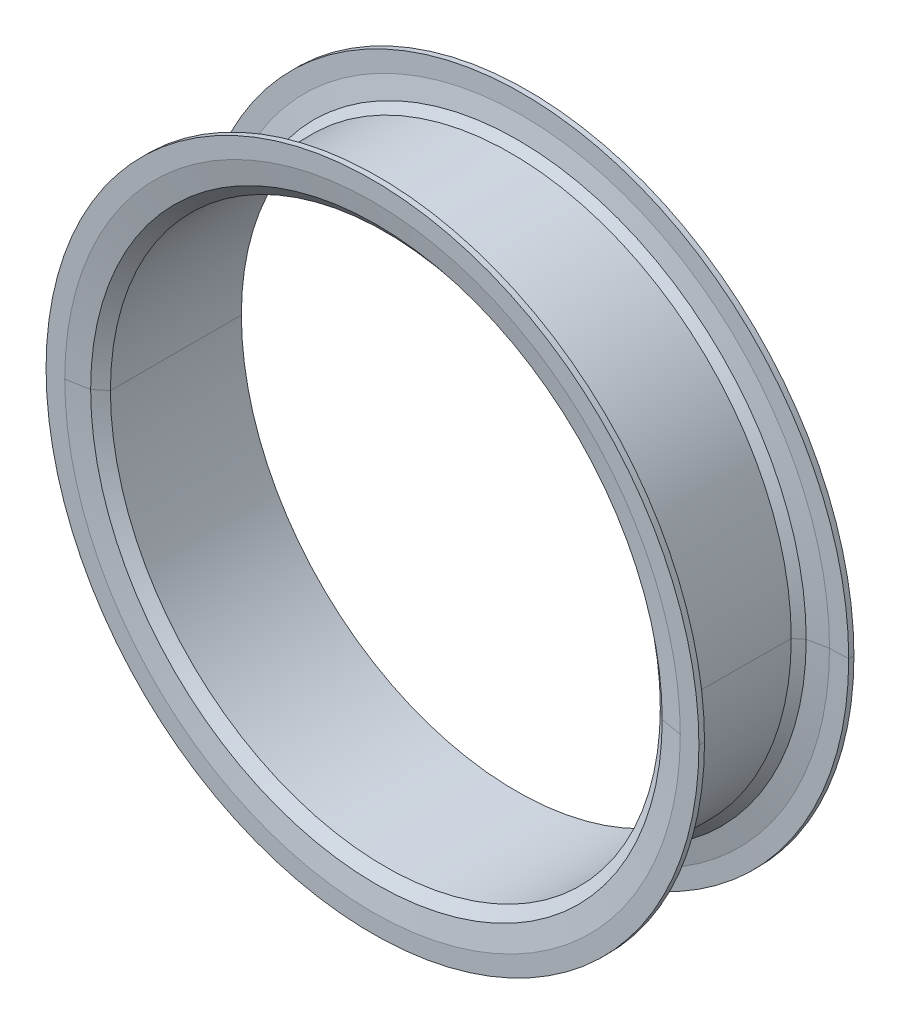
ISO-10303-21;
HEADER;
FILE_DESCRIPTION(('STEP AP214'),'2;1');
FILE_NAME('part.step','',(''),(''),'','','');
FILE_SCHEMA(('AUTOMOTIVE_DESIGN { 1 0 10303 214 1 1 1 1 }'));
ENDSEC;
DATA;
#1=APPLICATION_CONTEXT('core data for automotive mechanical design processes');
#2=APPLICATION_PROTOCOL_DEFINITION('international standard','automotive_design',2000,#1);
#3=PRODUCT_CONTEXT('',#1,'mechanical');
#4=PRODUCT('Part','Part','',(#3));
#5=PRODUCT_RELATED_PRODUCT_CATEGORY('part','',(#4));
#6=PRODUCT_DEFINITION_FORMATION('','',#4);
#7=PRODUCT_DEFINITION_CONTEXT('part definition',#1,'design');
#8=PRODUCT_DEFINITION('design','',#6,#7);
#9=PRODUCT_DEFINITION_SHAPE('','',#8);
#10=(LENGTH_UNIT() NAMED_UNIT(*) SI_UNIT(.MILLI.,.METRE.));
#11=(NAMED_UNIT(*) PLANE_ANGLE_UNIT() SI_UNIT($,.RADIAN.));
#12=(NAMED_UNIT(*) SI_UNIT($,.STERADIAN.) SOLID_ANGLE_UNIT());
#13=UNCERTAINTY_MEASURE_WITH_UNIT(LENGTH_MEASURE(1.E-05),#10,'distance_accuracy_value','');
#14=(GEOMETRIC_REPRESENTATION_CONTEXT(3) GLOBAL_UNCERTAINTY_ASSIGNED_CONTEXT((#13)) GLOBAL_UNIT_ASSIGNED_CONTEXT((#10,
#11,#12)) REPRESENTATION_CONTEXT('',''));
#15=CARTESIAN_POINT('',(0.,0.,0.));
#16=DIRECTION('',(0.,0.,1.));
#17=DIRECTION('',(1.,0.,0.));
#18=AXIS2_PLACEMENT_3D('',#15,#16,#17);
#19=CARTESIAN_POINT('',(0.,0.,31.5));
#20=DIRECTION('',(0.,0.,1.));
#21=DIRECTION('',(1.,0.,0.));
#22=AXIS2_PLACEMENT_3D('',#19,#20,#21);
#23=CONICAL_SURFACE('',#22,150.3,0.879459398025432);
#24=DIRECTION('',(0.770394321124688,0.,0.637567714034228));
#25=VECTOR('',#24,1.);
#26=CARTESIAN_POINT('',(150.3,0.,31.5));
#27=LINE('',#26,#25);
#28=CARTESIAN_POINT('',(147.4,0.,29.1));
#29=VERTEX_POINT('',#28);
#30=CARTESIAN_POINT('',(153.2,0.,33.9));
#31=VERTEX_POINT('',#30);
#32=EDGE_CURVE('E62',#29,#31,#27,.T.);
#33=ORIENTED_EDGE('',*,*,#32,.F.);
#34=CARTESIAN_POINT('',(0.,0.,29.1));
#35=DIRECTION('',(0.,0.,1.));
#36=DIRECTION('',(1.,0.,0.));
#37=AXIS2_PLACEMENT_3D('',#34,#35,#36);
#38=CIRCLE('',#37,147.4);
#39=CARTESIAN_POINT('',(-147.4,0.,29.1));
#40=VERTEX_POINT('',#39);
#41=EDGE_CURVE('E191',#40,#29,#38,.T.);
#42=ORIENTED_EDGE('',*,*,#41,.F.);
#43=DIRECTION('',(0.770394321124688,0.,-0.637567714034228));
#44=VECTOR('',#43,1.);
#45=CARTESIAN_POINT('',(-150.3,0.,31.5));
#46=LINE('',#45,#44);
#47=CARTESIAN_POINT('',(-153.2,0.,33.9));
#48=VERTEX_POINT('',#47);
#49=EDGE_CURVE('E202',#48,#40,#46,.T.);
#50=ORIENTED_EDGE('',*,*,#49,.F.);
#51=CARTESIAN_POINT('',(0.,0.,33.9));
#52=DIRECTION('',(0.,0.,1.));
#53=DIRECTION('',(1.,0.,0.));
#54=AXIS2_PLACEMENT_3D('',#51,#52,#53);
#55=CIRCLE('',#54,153.2);
#56=EDGE_CURVE('E11',#48,#31,#55,.T.);
#57=ORIENTED_EDGE('',*,*,#56,.T.);
#58=EDGE_LOOP('',(#33,#42,#50,#57));
#59=FACE_BOUND('',#58,.T.);
#60=ADVANCED_FACE('F44',(#59),#23,.F.);
#61=CARTESIAN_POINT('',(0.,0.,34.95));
#62=DIRECTION('',(0.,0.,1.));
#63=DIRECTION('',(1.,0.,0.));
#64=AXIS2_PLACEMENT_3D('',#61,#62,#63);
#65=CONICAL_SURFACE('',#64,159.1,1.39467415296908);
#66=DIRECTION('',(0.984530539330824,0.,0.175213062084299));
#67=VECTOR('',#66,1.);
#68=CARTESIAN_POINT('',(159.1,0.,34.95));
#69=LINE('',#68,#67);
#70=CARTESIAN_POINT('',(165.,0.,36.));
#71=VERTEX_POINT('',#70);
#72=EDGE_CURVE('E231',#31,#71,#69,.T.);
#73=ORIENTED_EDGE('',*,*,#72,.F.);
#74=ORIENTED_EDGE('',*,*,#56,.F.);
#75=DIRECTION('',(0.984530539330824,0.,-0.175213062084299));
#76=VECTOR('',#75,1.);
#77=CARTESIAN_POINT('',(-159.1,0.,34.95));
#78=LINE('',#77,#76);
#79=CARTESIAN_POINT('',(-165.,0.,36.));
#80=VERTEX_POINT('',#79);
#81=EDGE_CURVE('E280',#80,#48,#78,.T.);
#82=ORIENTED_EDGE('',*,*,#81,.F.);
#83=CARTESIAN_POINT('',(0.,0.,36.));
#84=DIRECTION('',(0.,0.,1.));
#85=DIRECTION('',(1.,0.,0.));
#86=AXIS2_PLACEMENT_3D('',#83,#84,#85);
#87=CIRCLE('',#86,165.);
#88=EDGE_CURVE('E54',#80,#71,#87,.T.);
#89=ORIENTED_EDGE('',*,*,#88,.T.);
#90=EDGE_LOOP('',(#73,#74,#82,#89));
#91=FACE_BOUND('',#90,.T.);
#92=ADVANCED_FACE('F395',(#91),#65,.F.);
#93=CARTESIAN_POINT('',(0.,0.,34.5));
#94=DIRECTION('',(0.,0.,1.));
#95=DIRECTION('',(1.,0.,0.));
#96=AXIS2_PLACEMENT_3D('',#93,#94,#95);
#97=CYLINDRICAL_SURFACE('',#96,175.);
#98=DIRECTION('',(0.,0.,1.));
#99=VECTOR('',#98,1.);
#100=CARTESIAN_POINT('',(175.,0.,34.5));
#101=LINE('',#100,#99);
#102=CARTESIAN_POINT('',(175.,0.,33.));
#103=VERTEX_POINT('',#102);
#104=CARTESIAN_POINT('',(175.,0.,36.));
#105=VERTEX_POINT('',#104);
#106=EDGE_CURVE('E224',#103,#105,#101,.T.);
#107=ORIENTED_EDGE('',*,*,#106,.F.);
#108=CARTESIAN_POINT('',(0.,0.,33.));
#109=DIRECTION('',(0.,0.,1.));
#110=DIRECTION('',(1.,0.,0.));
#111=AXIS2_PLACEMENT_3D('',#108,#109,#110);
#112=CIRCLE('',#111,175.);
#113=CARTESIAN_POINT('',(-175.,0.,33.));
#114=VERTEX_POINT('',#113);
#115=EDGE_CURVE('E198',#103,#114,#112,.T.);
#116=ORIENTED_EDGE('',*,*,#115,.T.);
#117=DIRECTION('',(0.,0.,-1.));
#118=VECTOR('',#117,1.);
#119=CARTESIAN_POINT('',(-175.,0.,34.5));
#120=LINE('',#119,#118);
#121=CARTESIAN_POINT('',(-175.,0.,36.));
#122=VERTEX_POINT('',#121);
#123=EDGE_CURVE('E217',#122,#114,#120,.T.);
#124=ORIENTED_EDGE('',*,*,#123,.F.);
#125=CARTESIAN_POINT('',(0.,0.,36.));
#126=DIRECTION('',(0.,0.,1.));
#127=DIRECTION('',(1.,0.,0.));
#128=AXIS2_PLACEMENT_3D('',#125,#126,#127);
#129=CIRCLE('',#128,175.);
#130=EDGE_CURVE('E218',#105,#122,#129,.T.);
#131=ORIENTED_EDGE('',*,*,#130,.F.);
#132=EDGE_LOOP('',(#107,#116,#124,#131));
#133=FACE_BOUND('',#132,.T.);
#134=ADVANCED_FACE('F380',(#133),#97,.T.);
#135=CARTESIAN_POINT('',(0.,0.,32.9));
#136=DIRECTION('',(0.,0.,1.));
#137=DIRECTION('',(1.,0.,0.));
#138=AXIS2_PLACEMENT_3D('',#135,#136,#137);
#139=CONICAL_SURFACE('',#138,170.,1.55079899282175);
#140=DIRECTION('',(0.999800059980007,0.,0.0199960011996004));
#141=VECTOR('',#140,1.);
#142=CARTESIAN_POINT('',(170.,0.,32.9));
#143=LINE('',#142,#141);
#144=CARTESIAN_POINT('',(165.,0.,32.8));
#145=VERTEX_POINT('',#144);
#146=EDGE_CURVE('E182',#145,#103,#143,.T.);
#147=ORIENTED_EDGE('',*,*,#146,.F.);
#148=CARTESIAN_POINT('',(0.,0.,32.8));
#149=DIRECTION('',(0.,0.,1.));
#150=DIRECTION('',(1.,0.,0.));
#151=AXIS2_PLACEMENT_3D('',#148,#149,#150);
#152=CIRCLE('',#151,165.);
#153=CARTESIAN_POINT('',(-165.,0.,32.8));
#154=VERTEX_POINT('',#153);
#155=EDGE_CURVE('E179',#145,#154,#152,.T.);
#156=ORIENTED_EDGE('',*,*,#155,.T.);
#157=DIRECTION('',(0.999800059980007,0.,-0.0199960011996004));
#158=VECTOR('',#157,1.);
#159=CARTESIAN_POINT('',(-170.,0.,32.9));
#160=LINE('',#159,#158);
#161=EDGE_CURVE('E185',#114,#154,#160,.T.);
#162=ORIENTED_EDGE('',*,*,#161,.F.);
#163=ORIENTED_EDGE('',*,*,#115,.F.);
#164=EDGE_LOOP('',(#147,#156,#162,#163));
#165=FACE_BOUND('',#164,.T.);
#166=ADVANCED_FACE('F371',(#165),#139,.T.);
#167=CARTESIAN_POINT('',(0.,0.,31.75));
#168=DIRECTION('',(0.,0.,1.));
#169=DIRECTION('',(1.,0.,0.));
#170=AXIS2_PLACEMENT_3D('',#167,#168,#169);
#171=CONICAL_SURFACE('',#170,159.5,1.38215711057039);
#172=DIRECTION('',(0.982260321953668,0.,0.187522425100245));
#173=VECTOR('',#172,1.);
#174=CARTESIAN_POINT('',(159.5,0.,31.75));
#175=LINE('',#174,#173);
#176=CARTESIAN_POINT('',(154.,0.,30.7));
#177=VERTEX_POINT('',#176);
#178=EDGE_CURVE('E160',#177,#145,#175,.T.);
#179=ORIENTED_EDGE('',*,*,#178,.F.);
#180=CARTESIAN_POINT('',(0.,0.,30.7));
#181=DIRECTION('',(0.,0.,1.));
#182=DIRECTION('',(1.,0.,0.));
#183=AXIS2_PLACEMENT_3D('',#180,#181,#182);
#184=CIRCLE('',#183,154.);
#185=CARTESIAN_POINT('',(-154.,0.,30.7));
#186=VERTEX_POINT('',#185);
#187=EDGE_CURVE('E167',#177,#186,#184,.T.);
#188=ORIENTED_EDGE('',*,*,#187,.T.);
#189=DIRECTION('',(0.982260321953668,0.,-0.187522425100245));
#190=VECTOR('',#189,1.);
#191=CARTESIAN_POINT('',(-159.5,0.,31.75));
#192=LINE('',#191,#190);
#193=EDGE_CURVE('E148',#154,#186,#192,.T.);
#194=ORIENTED_EDGE('',*,*,#193,.F.);
#195=ORIENTED_EDGE('',*,*,#155,.F.);
#196=EDGE_LOOP('',(#179,#188,#194,#195));
#197=FACE_BOUND('',#196,.T.);
#198=ADVANCED_FACE('F177',(#197),#171,.T.);
#199=CARTESIAN_POINT('',(0.,0.,28.5));
#200=DIRECTION('',(0.,0.,1.));
#201=DIRECTION('',(1.,0.,0.));
#202=AXIS2_PLACEMENT_3D('',#199,#200,#201);
#203=CONICAL_SURFACE('',#202,151.9,0.762146540586983);
#204=DIRECTION('',(0.690475746682499,0.,0.723355544143574));
#205=VECTOR('',#204,1.);
#206=CARTESIAN_POINT('',(151.9,0.,28.5));
#207=LINE('',#206,#205);
#208=CARTESIAN_POINT('',(149.8,0.,26.3));
#209=VERTEX_POINT('',#208);
#210=EDGE_CURVE('E174',#209,#177,#207,.T.);
#211=ORIENTED_EDGE('',*,*,#210,.F.);
#212=CARTESIAN_POINT('',(0.,0.,26.3));
#213=DIRECTION('',(0.,0.,1.));
#214=DIRECTION('',(1.,0.,0.));
#215=AXIS2_PLACEMENT_3D('',#212,#213,#214);
#216=CIRCLE('',#215,149.8);
#217=CARTESIAN_POINT('',(-149.8,0.,26.3));
#218=VERTEX_POINT('',#217);
#219=EDGE_CURVE('E169',#209,#218,#216,.T.);
#220=ORIENTED_EDGE('',*,*,#219,.T.);
#221=DIRECTION('',(0.690475746682499,0.,-0.723355544143574));
#222=VECTOR('',#221,1.);
#223=CARTESIAN_POINT('',(-151.9,0.,28.5));
#224=LINE('',#223,#222);
#225=EDGE_CURVE('E165',#186,#218,#224,.T.);
#226=ORIENTED_EDGE('',*,*,#225,.F.);
#227=ORIENTED_EDGE('',*,*,#187,.F.);
#228=EDGE_LOOP('',(#211,#220,#226,#227));
#229=FACE_BOUND('',#228,.T.);
#230=ADVANCED_FACE('F166',(#229),#203,.T.);
#231=CARTESIAN_POINT('',(0.,0.,-6.));
#232=DIRECTION('',(0.,0.,-1.));
#233=DIRECTION('',(1.,0.,0.));
#234=AXIS2_PLACEMENT_3D('',#231,#232,#233);
#235=CONICAL_SURFACE('',#234,150.,0.00619187133254888);
#236=DIRECTION('',(-0.00619183176734297,0.,0.999980830425946));
#237=VECTOR('',#236,1.);
#238=CARTESIAN_POINT('',(150.,0.,-6.));
#239=LINE('',#238,#237);
#240=CARTESIAN_POINT('',(150.2,0.,-38.3));
#241=VERTEX_POINT('',#240);
#242=EDGE_CURVE('E48',#241,#209,#239,.T.);
#243=ORIENTED_EDGE('',*,*,#242,.F.);
#244=CARTESIAN_POINT('',(0.,0.,-38.3));
#245=DIRECTION('',(0.,0.,1.));
#246=DIRECTION('',(1.,0.,0.));
#247=AXIS2_PLACEMENT_3D('',#244,#245,#246);
#248=CIRCLE('',#247,150.2);
#249=CARTESIAN_POINT('',(-150.2,0.,-38.3));
#250=VERTEX_POINT('',#249);
#251=EDGE_CURVE('E213',#241,#250,#248,.T.);
#252=ORIENTED_EDGE('',*,*,#251,.T.);
#253=DIRECTION('',(-0.00619183176734297,0.,-0.999980830425946));
#254=VECTOR('',#253,1.);
#255=CARTESIAN_POINT('',(-150.,0.,-6.));
#256=LINE('',#255,#254);
#257=EDGE_CURVE('E261',#218,#250,#256,.T.);
#258=ORIENTED_EDGE('',*,*,#257,.F.);
#259=ORIENTED_EDGE('',*,*,#219,.F.);
#260=EDGE_LOOP('',(#243,#252,#258,#259));
#261=FACE_BOUND('',#260,.T.);
#262=ADVANCED_FACE('F420',(#261),#235,.T.);
#263=CARTESIAN_POINT('',(0.,0.,-40.1));
#264=DIRECTION('',(0.,0.,-1.));
#265=DIRECTION('',(1.,0.,0.));
#266=AXIS2_PLACEMENT_3D('',#263,#264,#265);
#267=CONICAL_SURFACE('',#266,152.4,0.885066815888611);
#268=DIRECTION('',(-0.773957299203321,0.,0.633237790257262));
#269=VECTOR('',#268,1.);
#270=CARTESIAN_POINT('',(152.4,0.,-40.1));
#271=LINE('',#270,#269);
#272=CARTESIAN_POINT('',(154.6,0.,-41.9));
#273=VERTEX_POINT('',#272);
#274=EDGE_CURVE('E238',#273,#241,#271,.T.);
#275=ORIENTED_EDGE('',*,*,#274,.F.);
#276=CARTESIAN_POINT('',(0.,0.,-41.9));
#277=DIRECTION('',(0.,0.,1.));
#278=DIRECTION('',(1.,0.,0.));
#279=AXIS2_PLACEMENT_3D('',#276,#277,#278);
#280=CIRCLE('',#279,154.6);
#281=CARTESIAN_POINT('',(-154.6,0.,-41.9));
#282=VERTEX_POINT('',#281);
#283=EDGE_CURVE('E258',#273,#282,#280,.T.);
#284=ORIENTED_EDGE('',*,*,#283,.T.);
#285=DIRECTION('',(-0.773957299203321,0.,-0.633237790257262));
#286=VECTOR('',#285,1.);
#287=CARTESIAN_POINT('',(-152.4,0.,-40.1));
#288=LINE('',#287,#286);
#289=EDGE_CURVE('E235',#250,#282,#288,.T.);
#290=ORIENTED_EDGE('',*,*,#289,.F.);
#291=ORIENTED_EDGE('',*,*,#251,.F.);
#292=EDGE_LOOP('',(#275,#284,#290,#291));
#293=FACE_BOUND('',#292,.T.);
#294=ADVANCED_FACE('F303',(#293),#267,.T.);
#295=CARTESIAN_POINT('',(0.,0.,-42.95));
#296=DIRECTION('',(0.,0.,-1.));
#297=DIRECTION('',(1.,0.,0.));
#298=AXIS2_PLACEMENT_3D('',#295,#296,#297);
#299=CONICAL_SURFACE('',#298,159.8,1.37155234021469);
#300=DIRECTION('',(-0.980216494425521,0.,0.197928330605153));
#301=VECTOR('',#300,1.);
#302=CARTESIAN_POINT('',(159.8,0.,-42.95));
#303=LINE('',#302,#301);
#304=CARTESIAN_POINT('',(165.,0.,-44.));
#305=VERTEX_POINT('',#304);
#306=EDGE_CURVE('E314',#305,#273,#303,.T.);
#307=ORIENTED_EDGE('',*,*,#306,.F.);
#308=CARTESIAN_POINT('',(0.,0.,-44.));
#309=DIRECTION('',(0.,0.,1.));
#310=DIRECTION('',(1.,0.,0.));
#311=AXIS2_PLACEMENT_3D('',#308,#309,#310);
#312=CIRCLE('',#311,165.);
#313=CARTESIAN_POINT('',(-165.,0.,-44.));
#314=VERTEX_POINT('',#313);
#315=EDGE_CURVE('E274',#305,#314,#312,.T.);
#316=ORIENTED_EDGE('',*,*,#315,.T.);
#317=DIRECTION('',(-0.980216494425521,0.,-0.197928330605153));
#318=VECTOR('',#317,1.);
#319=CARTESIAN_POINT('',(-159.8,0.,-42.95));
#320=LINE('',#319,#318);
#321=EDGE_CURVE('E289',#282,#314,#320,.T.);
#322=ORIENTED_EDGE('',*,*,#321,.F.);
#323=ORIENTED_EDGE('',*,*,#283,.F.);
#324=EDGE_LOOP('',(#307,#316,#322,#323));
#325=FACE_BOUND('',#324,.T.);
#326=ADVANCED_FACE('F342',(#325),#299,.T.);
#327=CARTESIAN_POINT('',(0.,0.,-44.15));
#328=DIRECTION('',(0.,0.,-1.));
#329=DIRECTION('',(1.,0.,0.));
#330=AXIS2_PLACEMENT_3D('',#327,#328,#329);
#331=CONICAL_SURFACE('',#330,170.,1.54080532193802);
#332=DIRECTION('',(-0.999550303522367,0.,0.0299865091056707));
#333=VECTOR('',#332,1.);
#334=CARTESIAN_POINT('',(170.,0.,-44.15));
#335=LINE('',#334,#333);
#336=CARTESIAN_POINT('',(175.,0.,-44.3));
#337=VERTEX_POINT('',#336);
#338=EDGE_CURVE('E219',#337,#305,#335,.T.);
#339=ORIENTED_EDGE('',*,*,#338,.F.);
#340=CARTESIAN_POINT('',(0.,0.,-44.3));
#341=DIRECTION('',(0.,0.,1.));
#342=DIRECTION('',(1.,0.,0.));
#343=AXIS2_PLACEMENT_3D('',#340,#341,#342);
#344=CIRCLE('',#343,175.);
#345=CARTESIAN_POINT('',(-175.,0.,-44.3));
#346=VERTEX_POINT('',#345);
#347=EDGE_CURVE('E271',#337,#346,#344,.T.);
#348=ORIENTED_EDGE('',*,*,#347,.T.);
#349=DIRECTION('',(-0.999550303522367,0.,-0.0299865091056707));
#350=VECTOR('',#349,1.);
#351=CARTESIAN_POINT('',(-170.,0.,-44.15));
#352=LINE('',#351,#350);
#353=EDGE_CURVE('E223',#314,#346,#352,.T.);
#354=ORIENTED_EDGE('',*,*,#353,.F.);
#355=ORIENTED_EDGE('',*,*,#315,.F.);
#356=EDGE_LOOP('',(#339,#348,#354,#355));
#357=FACE_BOUND('',#356,.T.);
#358=ADVANCED_FACE('F348',(#357),#331,.T.);
#359=CARTESIAN_POINT('',(0.,0.,-45.7));
#360=DIRECTION('',(0.,0.,1.));
#361=DIRECTION('',(1.,0.,0.));
#362=AXIS2_PLACEMENT_3D('',#359,#360,#361);
#363=CYLINDRICAL_SURFACE('',#362,175.);
#364=DIRECTION('',(0.,0.,1.));
#365=VECTOR('',#364,1.);
#366=CARTESIAN_POINT('',(175.,0.,-45.7));
#367=LINE('',#366,#365);
#368=CARTESIAN_POINT('',(175.,0.,-47.1));
#369=VERTEX_POINT('',#368);
#370=EDGE_CURVE('E203',#369,#337,#367,.T.);
#371=ORIENTED_EDGE('',*,*,#370,.F.);
#372=CARTESIAN_POINT('',(0.,0.,-47.1));
#373=DIRECTION('',(0.,0.,1.));
#374=DIRECTION('',(1.,0.,0.));
#375=AXIS2_PLACEMENT_3D('',#372,#373,#374);
#376=CIRCLE('',#375,175.);
#377=CARTESIAN_POINT('',(-175.,0.,-47.1));
#378=VERTEX_POINT('',#377);
#379=EDGE_CURVE('E275',#369,#378,#376,.T.);
#380=ORIENTED_EDGE('',*,*,#379,.T.);
#381=DIRECTION('',(0.,0.,-1.));
#382=VECTOR('',#381,1.);
#383=CARTESIAN_POINT('',(-175.,0.,-45.7));
#384=LINE('',#383,#382);
#385=EDGE_CURVE('E207',#346,#378,#384,.T.);
#386=ORIENTED_EDGE('',*,*,#385,.F.);
#387=ORIENTED_EDGE('',*,*,#347,.F.);
#388=EDGE_LOOP('',(#371,#380,#386,#387));
#389=FACE_BOUND('',#388,.T.);
#390=ADVANCED_FACE('F354',(#389),#363,.T.);
#391=CARTESIAN_POINT('',(0.,0.,-47.05));
#392=DIRECTION('',(0.,0.,-1.));
#393=DIRECTION('',(1.,0.,0.));
#394=AXIS2_PLACEMENT_3D('',#391,#392,#393);
#395=CONICAL_SURFACE('',#394,170.,1.56079666010823);
#396=DIRECTION('',(-0.999950003749687,0.,0.00999950003749702));
#397=VECTOR('',#396,1.);
#398=CARTESIAN_POINT('',(170.,0.,-47.05));
#399=LINE('',#398,#397);
#400=CARTESIAN_POINT('',(165.,0.,-47.));
#401=VERTEX_POINT('',#400);
#402=EDGE_CURVE('E230',#369,#401,#399,.T.);
#403=ORIENTED_EDGE('',*,*,#402,.F.);
#404=CARTESIAN_POINT('',(0.,0.,-47.1));
#405=DIRECTION('',(0.,0.,1.));
#406=DIRECTION('',(1.,0.,0.));
#407=AXIS2_PLACEMENT_3D('',#404,#405,#406);
#408=CIRCLE('',#407,175.);
#409=EDGE_CURVE('E222',#378,#369,#408,.T.);
#410=ORIENTED_EDGE('',*,*,#409,.F.);
#411=DIRECTION('',(-0.999950003749687,0.,-0.00999950003749702));
#412=VECTOR('',#411,1.);
#413=CARTESIAN_POINT('',(-170.,0.,-47.05));
#414=LINE('',#413,#412);
#415=CARTESIAN_POINT('',(-165.,0.,-47.));
#416=VERTEX_POINT('',#415);
#417=EDGE_CURVE('E206',#416,#378,#414,.T.);
#418=ORIENTED_EDGE('',*,*,#417,.F.);
#419=CARTESIAN_POINT('',(0.,0.,-47.));
#420=DIRECTION('',(0.,0.,1.));
#421=DIRECTION('',(1.,0.,0.));
#422=AXIS2_PLACEMENT_3D('',#419,#420,#421);
#423=CIRCLE('',#422,165.);
#424=EDGE_CURVE('E249',#416,#401,#423,.T.);
#425=ORIENTED_EDGE('',*,*,#424,.T.);
#426=EDGE_LOOP('',(#403,#410,#418,#425));
#427=FACE_BOUND('',#426,.T.);
#428=ADVANCED_FACE('F361',(#427),#395,.F.);
#429=CARTESIAN_POINT('',(0.,0.,-45.95));
#430=DIRECTION('',(0.,0.,-1.));
#431=DIRECTION('',(1.,0.,0.));
#432=AXIS2_PLACEMENT_3D('',#429,#430,#431);
#433=CONICAL_SURFACE('',#432,159.5,1.38215711057039);
#434=DIRECTION('',(-0.982260321953668,0.,0.187522425100246));
#435=VECTOR('',#434,1.);
#436=CARTESIAN_POINT('',(159.5,0.,-45.95));
#437=LINE('',#436,#435);
#438=CARTESIAN_POINT('',(154.,0.,-44.9));
#439=VERTEX_POINT('',#438);
#440=EDGE_CURVE('E244',#401,#439,#437,.T.);
#441=ORIENTED_EDGE('',*,*,#440,.F.);
#442=ORIENTED_EDGE('',*,*,#424,.F.);
#443=DIRECTION('',(-0.982260321953668,0.,-0.187522425100246));
#444=VECTOR('',#443,1.);
#445=CARTESIAN_POINT('',(-159.5,0.,-45.95));
#446=LINE('',#445,#444);
#447=CARTESIAN_POINT('',(-154.,0.,-44.9));
#448=VERTEX_POINT('',#447);
#449=EDGE_CURVE('E267',#448,#416,#446,.T.);
#450=ORIENTED_EDGE('',*,*,#449,.F.);
#451=CARTESIAN_POINT('',(0.,0.,-44.9));
#452=DIRECTION('',(0.,0.,1.));
#453=DIRECTION('',(1.,0.,0.));
#454=AXIS2_PLACEMENT_3D('',#451,#452,#453);
#455=CIRCLE('',#454,154.);
#456=EDGE_CURVE('E247',#448,#439,#455,.T.);
#457=ORIENTED_EDGE('',*,*,#456,.T.);
#458=EDGE_LOOP('',(#441,#442,#450,#457));
#459=FACE_BOUND('',#458,.T.);
#460=ADVANCED_FACE('F441',(#459),#433,.F.);
#461=CARTESIAN_POINT('',(0.,0.,-43.));
#462=DIRECTION('',(0.,0.,-1.));
#463=DIRECTION('',(1.,0.,0.));
#464=AXIS2_PLACEMENT_3D('',#461,#462,#463);
#465=CONICAL_SURFACE('',#464,150.7,1.04839289507837);
#466=DIRECTION('',(-0.866622456874169,0.,0.498964444866946));
#467=VECTOR('',#466,1.);
#468=CARTESIAN_POINT('',(150.7,0.,-43.));
#469=LINE('',#468,#467);
#470=CARTESIAN_POINT('',(147.4,0.,-41.1));
#471=VERTEX_POINT('',#470);
#472=EDGE_CURVE('E255',#439,#471,#469,.T.);
#473=ORIENTED_EDGE('',*,*,#472,.F.);
#474=ORIENTED_EDGE('',*,*,#456,.F.);
#475=DIRECTION('',(-0.866622456874169,0.,-0.498964444866946));
#476=VECTOR('',#475,1.);
#477=CARTESIAN_POINT('',(-150.7,0.,-43.));
#478=LINE('',#477,#476);
#479=CARTESIAN_POINT('',(-147.4,0.,-41.1));
#480=VERTEX_POINT('',#479);
#481=EDGE_CURVE('E240',#480,#448,#478,.T.);
#482=ORIENTED_EDGE('',*,*,#481,.F.);
#483=CARTESIAN_POINT('',(0.,0.,-41.1));
#484=DIRECTION('',(0.,0.,1.));
#485=DIRECTION('',(1.,0.,0.));
#486=AXIS2_PLACEMENT_3D('',#483,#484,#485);
#487=CIRCLE('',#486,147.4);
#488=EDGE_CURVE('E194',#480,#471,#487,.T.);
#489=ORIENTED_EDGE('',*,*,#488,.T.);
#490=EDGE_LOOP('',(#473,#474,#482,#489));
#491=FACE_BOUND('',#490,.T.);
#492=ADVANCED_FACE('F438',(#491),#465,.F.);
#493=CARTESIAN_POINT('',(0.,0.,-6.));
#494=DIRECTION('',(0.,0.,1.));
#495=DIRECTION('',(1.,0.,0.));
#496=AXIS2_PLACEMENT_3D('',#493,#494,#495);
#497=CYLINDRICAL_SURFACE('',#496,147.4);
#498=DIRECTION('',(0.,0.,1.));
#499=VECTOR('',#498,1.);
#500=CARTESIAN_POINT('',(147.4,0.,-6.));
#501=LINE('',#500,#499);
#502=EDGE_CURVE('E195',#471,#29,#501,.T.);
#503=ORIENTED_EDGE('',*,*,#502,.F.);
#504=ORIENTED_EDGE('',*,*,#488,.F.);
#505=DIRECTION('',(0.,0.,-1.));
#506=VECTOR('',#505,1.);
#507=CARTESIAN_POINT('',(-147.4,0.,-6.));
#508=LINE('',#507,#506);
#509=EDGE_CURVE('E276',#40,#480,#508,.T.);
#510=ORIENTED_EDGE('',*,*,#509,.F.);
#511=ORIENTED_EDGE('',*,*,#41,.T.);
#512=EDGE_LOOP('',(#503,#504,#510,#511));
#513=FACE_BOUND('',#512,.T.);
#514=ADVANCED_FACE('F407',(#513),#497,.F.);
#515=CARTESIAN_POINT('',(0.,0.,-6.));
#516=DIRECTION('',(0.,0.,1.));
#517=DIRECTION('',(1.,0.,0.));
#518=AXIS2_PLACEMENT_3D('',#515,#516,#517);
#519=CYLINDRICAL_SURFACE('',#518,147.4);
#520=ORIENTED_EDGE('',*,*,#502,.T.);
#521=CARTESIAN_POINT('',(0.,0.,29.1));
#522=DIRECTION('',(0.,0.,1.));
#523=DIRECTION('',(1.,0.,0.));
#524=AXIS2_PLACEMENT_3D('',#521,#522,#523);
#525=CIRCLE('',#524,147.4);
#526=EDGE_CURVE('E211',#29,#40,#525,.T.);
#527=ORIENTED_EDGE('',*,*,#526,.T.);
#528=ORIENTED_EDGE('',*,*,#509,.T.);
#529=CARTESIAN_POINT('',(0.,0.,-41.1));
#530=DIRECTION('',(0.,0.,1.));
#531=DIRECTION('',(1.,0.,0.));
#532=AXIS2_PLACEMENT_3D('',#529,#530,#531);
#533=CIRCLE('',#532,147.4);
#534=EDGE_CURVE('E243',#471,#480,#533,.T.);
#535=ORIENTED_EDGE('',*,*,#534,.F.);
#536=EDGE_LOOP('',(#520,#527,#528,#535));
#537=FACE_BOUND('',#536,.T.);
#538=ADVANCED_FACE('F402',(#537),#519,.F.);
#539=CARTESIAN_POINT('',(0.,0.,-43.));
#540=DIRECTION('',(0.,0.,-1.));
#541=DIRECTION('',(1.,0.,0.));
#542=AXIS2_PLACEMENT_3D('',#539,#540,#541);
#543=CONICAL_SURFACE('',#542,150.7,1.04839289507837);
#544=ORIENTED_EDGE('',*,*,#472,.T.);
#545=ORIENTED_EDGE('',*,*,#534,.T.);
#546=ORIENTED_EDGE('',*,*,#481,.T.);
#547=CARTESIAN_POINT('',(0.,0.,-44.9));
#548=DIRECTION('',(0.,0.,1.));
#549=DIRECTION('',(1.,0.,0.));
#550=AXIS2_PLACEMENT_3D('',#547,#548,#549);
#551=CIRCLE('',#550,154.);
#552=EDGE_CURVE('E270',#439,#448,#551,.T.);
#553=ORIENTED_EDGE('',*,*,#552,.F.);
#554=EDGE_LOOP('',(#544,#545,#546,#553));
#555=FACE_BOUND('',#554,.T.);
#556=ADVANCED_FACE('F456',(#555),#543,.F.);
#557=CARTESIAN_POINT('',(0.,0.,-45.95));
#558=DIRECTION('',(0.,0.,-1.));
#559=DIRECTION('',(1.,0.,0.));
#560=AXIS2_PLACEMENT_3D('',#557,#558,#559);
#561=CONICAL_SURFACE('',#560,159.5,1.38215711057039);
#562=ORIENTED_EDGE('',*,*,#440,.T.);
#563=ORIENTED_EDGE('',*,*,#552,.T.);
#564=ORIENTED_EDGE('',*,*,#449,.T.);
#565=CARTESIAN_POINT('',(0.,0.,-47.));
#566=DIRECTION('',(0.,0.,1.));
#567=DIRECTION('',(1.,0.,0.));
#568=AXIS2_PLACEMENT_3D('',#565,#566,#567);
#569=CIRCLE('',#568,165.);
#570=EDGE_CURVE('E227',#401,#416,#569,.T.);
#571=ORIENTED_EDGE('',*,*,#570,.F.);
#572=EDGE_LOOP('',(#562,#563,#564,#571));
#573=FACE_BOUND('',#572,.T.);
#574=ADVANCED_FACE('F454',(#573),#561,.F.);
#575=CARTESIAN_POINT('',(0.,0.,-47.05));
#576=DIRECTION('',(0.,0.,-1.));
#577=DIRECTION('',(1.,0.,0.));
#578=AXIS2_PLACEMENT_3D('',#575,#576,#577);
#579=CONICAL_SURFACE('',#578,170.,1.56079666010823);
#580=ORIENTED_EDGE('',*,*,#402,.T.);
#581=ORIENTED_EDGE('',*,*,#570,.T.);
#582=ORIENTED_EDGE('',*,*,#417,.T.);
#583=ORIENTED_EDGE('',*,*,#379,.F.);
#584=EDGE_LOOP('',(#580,#581,#582,#583));
#585=FACE_BOUND('',#584,.T.);
#586=ADVANCED_FACE('F366',(#585),#579,.F.);
#587=CARTESIAN_POINT('',(0.,0.,-45.7));
#588=DIRECTION('',(0.,0.,1.));
#589=DIRECTION('',(1.,0.,0.));
#590=AXIS2_PLACEMENT_3D('',#587,#588,#589);
#591=CYLINDRICAL_SURFACE('',#590,175.);
#592=ORIENTED_EDGE('',*,*,#370,.T.);
#593=CARTESIAN_POINT('',(0.,0.,-44.3));
#594=DIRECTION('',(0.,0.,1.));
#595=DIRECTION('',(1.,0.,0.));
#596=AXIS2_PLACEMENT_3D('',#593,#594,#595);
#597=CIRCLE('',#596,175.);
#598=EDGE_CURVE('E266',#346,#337,#597,.T.);
#599=ORIENTED_EDGE('',*,*,#598,.F.);
#600=ORIENTED_EDGE('',*,*,#385,.T.);
#601=ORIENTED_EDGE('',*,*,#409,.T.);
#602=EDGE_LOOP('',(#592,#599,#600,#601));
#603=FACE_BOUND('',#602,.T.);
#604=ADVANCED_FACE('F357',(#603),#591,.T.);
#605=CARTESIAN_POINT('',(0.,0.,-44.15));
#606=DIRECTION('',(0.,0.,-1.));
#607=DIRECTION('',(1.,0.,0.));
#608=AXIS2_PLACEMENT_3D('',#605,#606,#607);
#609=CONICAL_SURFACE('',#608,170.,1.54080532193802);
#610=ORIENTED_EDGE('',*,*,#338,.T.);
#611=CARTESIAN_POINT('',(0.,0.,-44.));
#612=DIRECTION('',(0.,0.,1.));
#613=DIRECTION('',(1.,0.,0.));
#614=AXIS2_PLACEMENT_3D('',#611,#612,#613);
#615=CIRCLE('',#614,165.);
#616=EDGE_CURVE('E286',#314,#305,#615,.T.);
#617=ORIENTED_EDGE('',*,*,#616,.F.);
#618=ORIENTED_EDGE('',*,*,#353,.T.);
#619=ORIENTED_EDGE('',*,*,#598,.T.);
#620=EDGE_LOOP('',(#610,#617,#618,#619));
#621=FACE_BOUND('',#620,.T.);
#622=ADVANCED_FACE('F345',(#621),#609,.T.);
#623=CARTESIAN_POINT('',(0.,0.,-42.95));
#624=DIRECTION('',(0.,0.,-1.));
#625=DIRECTION('',(1.,0.,0.));
#626=AXIS2_PLACEMENT_3D('',#623,#624,#625);
#627=CONICAL_SURFACE('',#626,159.8,1.37155234021469);
#628=ORIENTED_EDGE('',*,*,#306,.T.);
#629=CARTESIAN_POINT('',(0.,0.,-41.9));
#630=DIRECTION('',(0.,0.,1.));
#631=DIRECTION('',(1.,0.,0.));
#632=AXIS2_PLACEMENT_3D('',#629,#630,#631);
#633=CIRCLE('',#632,154.6);
#634=EDGE_CURVE('E239',#282,#273,#633,.T.);
#635=ORIENTED_EDGE('',*,*,#634,.F.);
#636=ORIENTED_EDGE('',*,*,#321,.T.);
#637=ORIENTED_EDGE('',*,*,#616,.T.);
#638=EDGE_LOOP('',(#628,#635,#636,#637));
#639=FACE_BOUND('',#638,.T.);
#640=ADVANCED_FACE('F338',(#639),#627,.T.);
#641=CARTESIAN_POINT('',(0.,0.,-40.1));
#642=DIRECTION('',(0.,0.,-1.));
#643=DIRECTION('',(1.,0.,0.));
#644=AXIS2_PLACEMENT_3D('',#641,#642,#643);
#645=CONICAL_SURFACE('',#644,152.4,0.885066815888611);
#646=ORIENTED_EDGE('',*,*,#274,.T.);
#647=CARTESIAN_POINT('',(0.,0.,-38.3));
#648=DIRECTION('',(0.,0.,1.));
#649=DIRECTION('',(1.,0.,0.));
#650=AXIS2_PLACEMENT_3D('',#647,#648,#649);
#651=CIRCLE('',#650,150.2);
#652=EDGE_CURVE('E263',#250,#241,#651,.T.);
#653=ORIENTED_EDGE('',*,*,#652,.F.);
#654=ORIENTED_EDGE('',*,*,#289,.T.);
#655=ORIENTED_EDGE('',*,*,#634,.T.);
#656=EDGE_LOOP('',(#646,#653,#654,#655));
#657=FACE_BOUND('',#656,.T.);
#658=ADVANCED_FACE('F296',(#657),#645,.T.);
#659=CARTESIAN_POINT('',(0.,0.,-6.));
#660=DIRECTION('',(0.,0.,-1.));
#661=DIRECTION('',(1.,0.,0.));
#662=AXIS2_PLACEMENT_3D('',#659,#660,#661);
#663=CONICAL_SURFACE('',#662,150.,0.00619187133254888);
#664=ORIENTED_EDGE('',*,*,#242,.T.);
#665=CARTESIAN_POINT('',(0.,0.,26.3));
#666=DIRECTION('',(0.,0.,1.));
#667=DIRECTION('',(1.,0.,0.));
#668=AXIS2_PLACEMENT_3D('',#665,#666,#667);
#669=CIRCLE('',#668,149.8);
#670=EDGE_CURVE('E175',#218,#209,#669,.T.);
#671=ORIENTED_EDGE('',*,*,#670,.F.);
#672=ORIENTED_EDGE('',*,*,#257,.T.);
#673=ORIENTED_EDGE('',*,*,#652,.T.);
#674=EDGE_LOOP('',(#664,#671,#672,#673));
#675=FACE_BOUND('',#674,.T.);
#676=ADVANCED_FACE('F307',(#675),#663,.T.);
#677=CARTESIAN_POINT('',(0.,0.,28.5));
#678=DIRECTION('',(0.,0.,1.));
#679=DIRECTION('',(1.,0.,0.));
#680=AXIS2_PLACEMENT_3D('',#677,#678,#679);
#681=CONICAL_SURFACE('',#680,151.9,0.762146540586983);
#682=ORIENTED_EDGE('',*,*,#210,.T.);
#683=CARTESIAN_POINT('',(0.,0.,30.7));
#684=DIRECTION('',(0.,0.,1.));
#685=DIRECTION('',(1.,0.,0.));
#686=AXIS2_PLACEMENT_3D('',#683,#684,#685);
#687=CIRCLE('',#686,154.);
#688=EDGE_CURVE('E153',#186,#177,#687,.T.);
#689=ORIENTED_EDGE('',*,*,#688,.F.);
#690=ORIENTED_EDGE('',*,*,#225,.T.);
#691=ORIENTED_EDGE('',*,*,#670,.T.);
#692=EDGE_LOOP('',(#682,#689,#690,#691));
#693=FACE_BOUND('',#692,.T.);
#694=ADVANCED_FACE('F181',(#693),#681,.T.);
#695=CARTESIAN_POINT('',(0.,0.,31.75));
#696=DIRECTION('',(0.,0.,1.));
#697=DIRECTION('',(1.,0.,0.));
#698=AXIS2_PLACEMENT_3D('',#695,#696,#697);
#699=CONICAL_SURFACE('',#698,159.5,1.38215711057039);
#700=ORIENTED_EDGE('',*,*,#178,.T.);
#701=CARTESIAN_POINT('',(0.,0.,32.8));
#702=DIRECTION('',(0.,0.,1.));
#703=DIRECTION('',(1.,0.,0.));
#704=AXIS2_PLACEMENT_3D('',#701,#702,#703);
#705=CIRCLE('',#704,165.);
#706=EDGE_CURVE('E155',#154,#145,#705,.T.);
#707=ORIENTED_EDGE('',*,*,#706,.F.);
#708=ORIENTED_EDGE('',*,*,#193,.T.);
#709=ORIENTED_EDGE('',*,*,#688,.T.);
#710=EDGE_LOOP('',(#700,#707,#708,#709));
#711=FACE_BOUND('',#710,.T.);
#712=ADVANCED_FACE('F151',(#711),#699,.T.);
#713=CARTESIAN_POINT('',(0.,0.,32.9));
#714=DIRECTION('',(0.,0.,1.));
#715=DIRECTION('',(1.,0.,0.));
#716=AXIS2_PLACEMENT_3D('',#713,#714,#715);
#717=CONICAL_SURFACE('',#716,170.,1.55079899282175);
#718=ORIENTED_EDGE('',*,*,#146,.T.);
#719=CARTESIAN_POINT('',(0.,0.,33.));
#720=DIRECTION('',(0.,0.,1.));
#721=DIRECTION('',(1.,0.,0.));
#722=AXIS2_PLACEMENT_3D('',#719,#720,#721);
#723=CIRCLE('',#722,175.);
#724=EDGE_CURVE('E214',#114,#103,#723,.T.);
#725=ORIENTED_EDGE('',*,*,#724,.F.);
#726=ORIENTED_EDGE('',*,*,#161,.T.);
#727=ORIENTED_EDGE('',*,*,#706,.T.);
#728=EDGE_LOOP('',(#718,#725,#726,#727));
#729=FACE_BOUND('',#728,.T.);
#730=ADVANCED_FACE('F46',(#729),#717,.T.);
#731=CARTESIAN_POINT('',(0.,0.,34.5));
#732=DIRECTION('',(0.,0.,1.));
#733=DIRECTION('',(1.,0.,0.));
#734=AXIS2_PLACEMENT_3D('',#731,#732,#733);
#735=CYLINDRICAL_SURFACE('',#734,175.);
#736=ORIENTED_EDGE('',*,*,#106,.T.);
#737=CARTESIAN_POINT('',(0.,0.,36.));
#738=DIRECTION('',(0.,0.,1.));
#739=DIRECTION('',(1.,0.,0.));
#740=AXIS2_PLACEMENT_3D('',#737,#738,#739);
#741=CIRCLE('',#740,175.);
#742=EDGE_CURVE('E233',#122,#105,#741,.T.);
#743=ORIENTED_EDGE('',*,*,#742,.F.);
#744=ORIENTED_EDGE('',*,*,#123,.T.);
#745=ORIENTED_EDGE('',*,*,#724,.T.);
#746=EDGE_LOOP('',(#736,#743,#744,#745));
#747=FACE_BOUND('',#746,.T.);
#748=ADVANCED_FACE('F376',(#747),#735,.T.);
#749=CARTESIAN_POINT('',(170.,0.,36.));
#750=DIRECTION('',(0.,0.,1.));
#751=DIRECTION('',(1.,0.,0.));
#752=AXIS2_PLACEMENT_3D('',#749,#750,#751);
#753=PLANE('',#752);
#754=ORIENTED_EDGE('',*,*,#130,.T.);
#755=ORIENTED_EDGE('',*,*,#742,.T.);
#756=EDGE_LOOP('',(#754,#755));
#757=FACE_BOUND('',#756,.T.);
#758=CARTESIAN_POINT('',(0.,0.,36.));
#759=DIRECTION('',(0.,0.,1.));
#760=DIRECTION('',(1.,0.,0.));
#761=AXIS2_PLACEMENT_3D('',#758,#759,#760);
#762=CIRCLE('',#761,165.);
#763=EDGE_CURVE('E189',#71,#80,#762,.T.);
#764=ORIENTED_EDGE('',*,*,#763,.F.);
#765=ORIENTED_EDGE('',*,*,#88,.F.);
#766=EDGE_LOOP('',(#764,#765));
#767=FACE_BOUND('',#766,.T.);
#768=ADVANCED_FACE('F382',(#757,#767),#753,.T.);
#769=CARTESIAN_POINT('',(0.,0.,34.95));
#770=DIRECTION('',(0.,0.,1.));
#771=DIRECTION('',(1.,0.,0.));
#772=AXIS2_PLACEMENT_3D('',#769,#770,#771);
#773=CONICAL_SURFACE('',#772,159.1,1.39467415296908);
#774=ORIENTED_EDGE('',*,*,#72,.T.);
#775=ORIENTED_EDGE('',*,*,#763,.T.);
#776=ORIENTED_EDGE('',*,*,#81,.T.);
#777=CARTESIAN_POINT('',(0.,0.,33.9));
#778=DIRECTION('',(0.,0.,1.));
#779=DIRECTION('',(1.,0.,0.));
#780=AXIS2_PLACEMENT_3D('',#777,#778,#779);
#781=CIRCLE('',#780,153.2);
#782=EDGE_CURVE('E199',#31,#48,#781,.T.);
#783=ORIENTED_EDGE('',*,*,#782,.F.);
#784=EDGE_LOOP('',(#774,#775,#776,#783));
#785=FACE_BOUND('',#784,.T.);
#786=ADVANCED_FACE('F385',(#785),#773,.F.);
#787=CARTESIAN_POINT('',(0.,0.,31.5));
#788=DIRECTION('',(0.,0.,1.));
#789=DIRECTION('',(1.,0.,0.));
#790=AXIS2_PLACEMENT_3D('',#787,#788,#789);
#791=CONICAL_SURFACE('',#790,150.3,0.879459398025432);
#792=ORIENTED_EDGE('',*,*,#32,.T.);
#793=ORIENTED_EDGE('',*,*,#782,.T.);
#794=ORIENTED_EDGE('',*,*,#49,.T.);
#795=ORIENTED_EDGE('',*,*,#526,.F.);
#796=EDGE_LOOP('',(#792,#793,#794,#795));
#797=FACE_BOUND('',#796,.T.);
#798=ADVANCED_FACE('F398',(#797),#791,.F.);
#799=CLOSED_SHELL('',(#60,#92,#134,#166,#198,#230,#262,#294,#326,#358,#390,#428,#460,#492,#514,
#538,#556,#574,#586,#604,#622,#640,#658,#676,#694,#712,#730,#748,#768,#786,#798));
#800=MANIFOLD_SOLID_BREP('B2',#799);
#801=ADVANCED_BREP_SHAPE_REPRESENTATION('',(#18,#800),#14);
#802=SHAPE_DEFINITION_REPRESENTATION(#9,#801);
ENDSEC;
END-ISO-10303-21;
